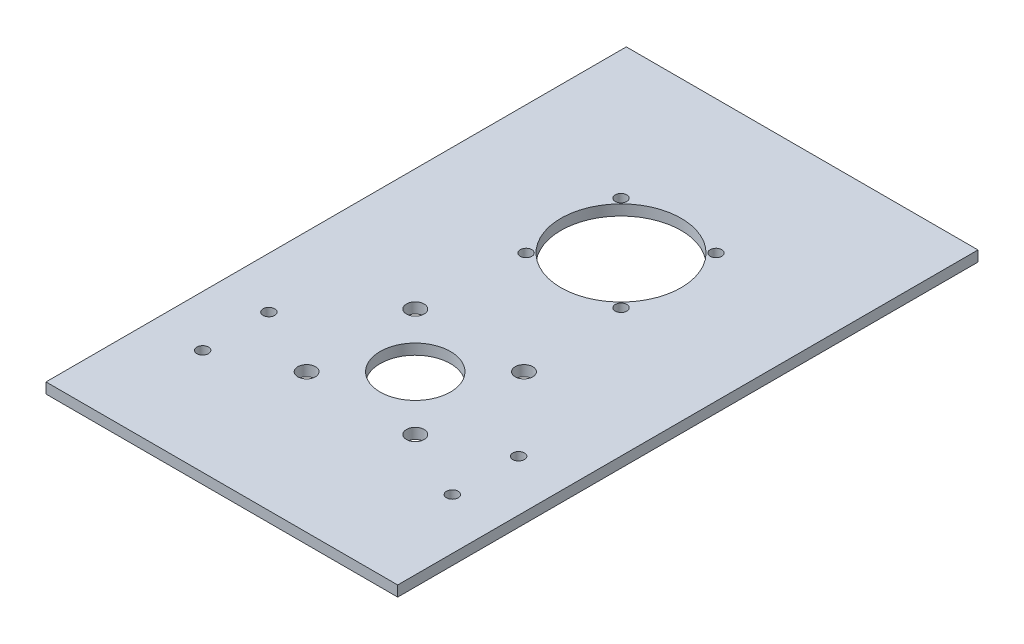
ISO-10303-21;
HEADER;
FILE_DESCRIPTION(('STEP AP214'),'2;1');
FILE_NAME('part.step','',(''),(''),'','','');
FILE_SCHEMA(('AUTOMOTIVE_DESIGN { 1 0 10303 214 1 1 1 1 }'));
ENDSEC;
DATA;
#1=APPLICATION_CONTEXT('core data for automotive mechanical design processes');
#2=APPLICATION_PROTOCOL_DEFINITION('international standard','automotive_design',2000,#1);
#3=PRODUCT_CONTEXT('',#1,'mechanical');
#4=PRODUCT('Part','Part','',(#3));
#5=PRODUCT_RELATED_PRODUCT_CATEGORY('part','',(#4));
#6=PRODUCT_DEFINITION_FORMATION('','',#4);
#7=PRODUCT_DEFINITION_CONTEXT('part definition',#1,'design');
#8=PRODUCT_DEFINITION('design','',#6,#7);
#9=PRODUCT_DEFINITION_SHAPE('','',#8);
#10=(LENGTH_UNIT() NAMED_UNIT(*) SI_UNIT(.MILLI.,.METRE.));
#11=(NAMED_UNIT(*) PLANE_ANGLE_UNIT() SI_UNIT($,.RADIAN.));
#12=(NAMED_UNIT(*) SI_UNIT($,.STERADIAN.) SOLID_ANGLE_UNIT());
#13=UNCERTAINTY_MEASURE_WITH_UNIT(LENGTH_MEASURE(1.E-05),#10,'distance_accuracy_value','');
#14=(GEOMETRIC_REPRESENTATION_CONTEXT(3) GLOBAL_UNCERTAINTY_ASSIGNED_CONTEXT((#13)) GLOBAL_UNIT_ASSIGNED_CONTEXT((#10,
#11,#12)) REPRESENTATION_CONTEXT('',''));
#15=CARTESIAN_POINT('',(0.,0.,0.));
#16=DIRECTION('',(0.,0.,1.));
#17=DIRECTION('',(1.,0.,0.));
#18=AXIS2_PLACEMENT_3D('',#15,#16,#17);
#19=CARTESIAN_POINT('',(0.,3.,0.));
#20=DIRECTION('',(0.,1.,0.));
#21=DIRECTION('',(0.,0.,1.));
#22=AXIS2_PLACEMENT_3D('',#19,#20,#21);
#23=PLANE('',#22);
#24=CARTESIAN_POINT('',(-35.5,3.,52.4648421845453));
#25=DIRECTION('',(0.,1.,0.));
#26=DIRECTION('',(0.,0.,1.));
#27=AXIS2_PLACEMENT_3D('',#24,#25,#26);
#28=CIRCLE('',#27,1.65);
#29=CARTESIAN_POINT('',(-35.5,3.,54.1148421845453));
#30=VERTEX_POINT('',#29);
#31=EDGE_CURVE('E187',#30,#30,#28,.T.);
#32=ORIENTED_EDGE('',*,*,#31,.F.);
#33=EDGE_LOOP('',(#32));
#34=FACE_BOUND('',#33,.T.);
#35=CARTESIAN_POINT('',(35.5,3.,33.6222296896705));
#36=DIRECTION('',(0.,1.,0.));
#37=DIRECTION('',(0.,0.,1.));
#38=AXIS2_PLACEMENT_3D('',#35,#36,#37);
#39=CIRCLE('',#38,1.65);
#40=CARTESIAN_POINT('',(35.5,3.,35.2722296896705));
#41=VERTEX_POINT('',#40);
#42=EDGE_CURVE('E175',#41,#41,#39,.T.);
#43=ORIENTED_EDGE('',*,*,#42,.F.);
#44=EDGE_LOOP('',(#43));
#45=FACE_BOUND('',#44,.T.);
#46=CARTESIAN_POINT('',(13.5,3.,-44.5));
#47=DIRECTION('',(0.,1.,0.));
#48=DIRECTION('',(0.,0.,1.));
#49=AXIS2_PLACEMENT_3D('',#46,#47,#48);
#50=CIRCLE('',#49,1.65);
#51=CARTESIAN_POINT('',(13.5,3.,-42.85));
#52=VERTEX_POINT('',#51);
#53=EDGE_CURVE('E163',#52,#52,#50,.T.);
#54=ORIENTED_EDGE('',*,*,#53,.F.);
#55=EDGE_LOOP('',(#54));
#56=FACE_BOUND('',#55,.T.);
#57=CARTESIAN_POINT('',(-13.5,3.,-17.5));
#58=DIRECTION('',(0.,1.,0.));
#59=DIRECTION('',(0.,0.,1.));
#60=AXIS2_PLACEMENT_3D('',#57,#58,#59);
#61=CIRCLE('',#60,1.65);
#62=CARTESIAN_POINT('',(-13.5,3.,-15.85));
#63=VERTEX_POINT('',#62);
#64=EDGE_CURVE('E151',#63,#63,#61,.T.);
#65=ORIENTED_EDGE('',*,*,#64,.F.);
#66=EDGE_LOOP('',(#65));
#67=FACE_BOUND('',#66,.T.);
#68=CARTESIAN_POINT('',(15.45,3.,12.05));
#69=DIRECTION('',(0.,1.,0.));
#70=DIRECTION('',(0.,0.,1.));
#71=AXIS2_PLACEMENT_3D('',#68,#69,#70);
#72=CIRCLE('',#71,2.5);
#73=CARTESIAN_POINT('',(15.45,3.,14.55));
#74=VERTEX_POINT('',#73);
#75=EDGE_CURVE('E139',#74,#74,#72,.T.);
#76=ORIENTED_EDGE('',*,*,#75,.F.);
#77=EDGE_LOOP('',(#76));
#78=FACE_BOUND('',#77,.T.);
#79=CARTESIAN_POINT('',(-15.45,3.,42.95));
#80=DIRECTION('',(0.,1.,0.));
#81=DIRECTION('',(0.,0.,1.));
#82=AXIS2_PLACEMENT_3D('',#79,#80,#81);
#83=CIRCLE('',#82,2.5);
#84=CARTESIAN_POINT('',(-15.45,3.,45.45));
#85=VERTEX_POINT('',#84);
#86=EDGE_CURVE('E127',#85,#85,#83,.T.);
#87=ORIENTED_EDGE('',*,*,#86,.F.);
#88=EDGE_LOOP('',(#87));
#89=FACE_BOUND('',#88,.T.);
#90=CARTESIAN_POINT('',(0.,3.,27.5));
#91=DIRECTION('',(0.,1.,0.));
#92=DIRECTION('',(0.,0.,1.));
#93=AXIS2_PLACEMENT_3D('',#90,#91,#92);
#94=CIRCLE('',#93,10.);
#95=CARTESIAN_POINT('',(0.,3.,37.5));
#96=VERTEX_POINT('',#95);
#97=EDGE_CURVE('E106',#96,#96,#94,.T.);
#98=ORIENTED_EDGE('',*,*,#97,.F.);
#99=EDGE_LOOP('',(#98));
#100=FACE_BOUND('',#99,.T.);
#101=DIRECTION('',(0.,0.,-1.));
#102=VECTOR('',#101,1.);
#103=CARTESIAN_POINT('',(50.,3.,-82.5));
#104=LINE('',#103,#102);
#105=CARTESIAN_POINT('',(50.,3.,82.5));
#106=VERTEX_POINT('',#105);
#107=CARTESIAN_POINT('',(50.,3.,-82.5));
#108=VERTEX_POINT('',#107);
#109=EDGE_CURVE('E91',#106,#108,#104,.T.);
#110=ORIENTED_EDGE('',*,*,#109,.T.);
#111=DIRECTION('',(-1.,0.,0.));
#112=VECTOR('',#111,1.);
#113=CARTESIAN_POINT('',(-50.,3.,-82.5));
#114=LINE('',#113,#112);
#115=CARTESIAN_POINT('',(-50.,3.,-82.5));
#116=VERTEX_POINT('',#115);
#117=EDGE_CURVE('E86',#108,#116,#114,.T.);
#118=ORIENTED_EDGE('',*,*,#117,.T.);
#119=DIRECTION('',(0.,0.,1.));
#120=VECTOR('',#119,1.);
#121=CARTESIAN_POINT('',(-50.,3.,-82.5));
#122=LINE('',#121,#120);
#123=CARTESIAN_POINT('',(-50.,3.,82.5));
#124=VERTEX_POINT('',#123);
#125=EDGE_CURVE('E89',#116,#124,#122,.T.);
#126=ORIENTED_EDGE('',*,*,#125,.T.);
#127=DIRECTION('',(1.,0.,0.));
#128=VECTOR('',#127,1.);
#129=CARTESIAN_POINT('',(-50.,3.,82.5));
#130=LINE('',#129,#128);
#131=EDGE_CURVE('E56',#124,#106,#130,.T.);
#132=ORIENTED_EDGE('',*,*,#131,.T.);
#133=EDGE_LOOP('',(#110,#118,#126,#132));
#134=FACE_BOUND('',#133,.T.);
#135=CARTESIAN_POINT('',(0.,3.,-31.));
#136=DIRECTION('',(0.,1.,0.));
#137=DIRECTION('',(0.,0.,1.));
#138=AXIS2_PLACEMENT_3D('',#135,#136,#137);
#139=CIRCLE('',#138,17.1);
#140=CARTESIAN_POINT('',(0.,3.,-13.9));
#141=VERTEX_POINT('',#140);
#142=EDGE_CURVE('E121',#141,#141,#139,.T.);
#143=ORIENTED_EDGE('',*,*,#142,.F.);
#144=EDGE_LOOP('',(#143));
#145=FACE_BOUND('',#144,.T.);
#146=CARTESIAN_POINT('',(15.45,3.,42.95));
#147=DIRECTION('',(0.,1.,0.));
#148=DIRECTION('',(0.,0.,1.));
#149=AXIS2_PLACEMENT_3D('',#146,#147,#148);
#150=CIRCLE('',#149,2.5);
#151=CARTESIAN_POINT('',(15.45,3.,45.45));
#152=VERTEX_POINT('',#151);
#153=EDGE_CURVE('E133',#152,#152,#150,.T.);
#154=ORIENTED_EDGE('',*,*,#153,.F.);
#155=EDGE_LOOP('',(#154));
#156=FACE_BOUND('',#155,.T.);
#157=CARTESIAN_POINT('',(-15.45,3.,12.05));
#158=DIRECTION('',(0.,1.,0.));
#159=DIRECTION('',(0.,0.,1.));
#160=AXIS2_PLACEMENT_3D('',#157,#158,#159);
#161=CIRCLE('',#160,2.5);
#162=CARTESIAN_POINT('',(-15.45,3.,14.55));
#163=VERTEX_POINT('',#162);
#164=EDGE_CURVE('E145',#163,#163,#161,.T.);
#165=ORIENTED_EDGE('',*,*,#164,.F.);
#166=EDGE_LOOP('',(#165));
#167=FACE_BOUND('',#166,.T.);
#168=CARTESIAN_POINT('',(13.5,3.,-17.5));
#169=DIRECTION('',(0.,1.,0.));
#170=DIRECTION('',(0.,0.,1.));
#171=AXIS2_PLACEMENT_3D('',#168,#169,#170);
#172=CIRCLE('',#171,1.65);
#173=CARTESIAN_POINT('',(13.5,3.,-15.85));
#174=VERTEX_POINT('',#173);
#175=EDGE_CURVE('E157',#174,#174,#172,.T.);
#176=ORIENTED_EDGE('',*,*,#175,.F.);
#177=EDGE_LOOP('',(#176));
#178=FACE_BOUND('',#177,.T.);
#179=CARTESIAN_POINT('',(-13.5,3.,-44.5));
#180=DIRECTION('',(0.,1.,0.));
#181=DIRECTION('',(0.,0.,1.));
#182=AXIS2_PLACEMENT_3D('',#179,#180,#181);
#183=CIRCLE('',#182,1.65);
#184=CARTESIAN_POINT('',(-13.5,3.,-42.85));
#185=VERTEX_POINT('',#184);
#186=EDGE_CURVE('E169',#185,#185,#183,.T.);
#187=ORIENTED_EDGE('',*,*,#186,.F.);
#188=EDGE_LOOP('',(#187));
#189=FACE_BOUND('',#188,.T.);
#190=CARTESIAN_POINT('',(35.5,3.,52.4648421845453));
#191=DIRECTION('',(0.,1.,0.));
#192=DIRECTION('',(0.,0.,1.));
#193=AXIS2_PLACEMENT_3D('',#190,#191,#192);
#194=CIRCLE('',#193,1.65);
#195=CARTESIAN_POINT('',(35.5,3.,54.1148421845453));
#196=VERTEX_POINT('',#195);
#197=EDGE_CURVE('E181',#196,#196,#194,.T.);
#198=ORIENTED_EDGE('',*,*,#197,.F.);
#199=EDGE_LOOP('',(#198));
#200=FACE_BOUND('',#199,.T.);
#201=CARTESIAN_POINT('',(-35.5,3.,33.6222296896705));
#202=DIRECTION('',(0.,1.,0.));
#203=DIRECTION('',(0.,0.,1.));
#204=AXIS2_PLACEMENT_3D('',#201,#202,#203);
#205=CIRCLE('',#204,1.65);
#206=CARTESIAN_POINT('',(-35.5,3.,35.2722296896705));
#207=VERTEX_POINT('',#206);
#208=EDGE_CURVE('E193',#207,#207,#205,.T.);
#209=ORIENTED_EDGE('',*,*,#208,.F.);
#210=EDGE_LOOP('',(#209));
#211=FACE_BOUND('',#210,.T.);
#212=ADVANCED_FACE('F39',(#34,#45,#56,#67,#78,#89,#100,#134,#145,#156,#167,#178,#189,#200,#211),
#23,.T.);
#213=CARTESIAN_POINT('',(0.,0.,0.));
#214=DIRECTION('',(0.,1.,0.));
#215=DIRECTION('',(0.,0.,1.));
#216=AXIS2_PLACEMENT_3D('',#213,#214,#215);
#217=PLANE('',#216);
#218=DIRECTION('',(0.,0.,-1.));
#219=VECTOR('',#218,1.);
#220=CARTESIAN_POINT('',(50.,0.,-82.5));
#221=LINE('',#220,#219);
#222=CARTESIAN_POINT('',(50.,0.,82.5));
#223=VERTEX_POINT('',#222);
#224=CARTESIAN_POINT('',(50.,0.,-82.5));
#225=VERTEX_POINT('',#224);
#226=EDGE_CURVE('E103',#223,#225,#221,.T.);
#227=ORIENTED_EDGE('',*,*,#226,.F.);
#228=DIRECTION('',(1.,0.,0.));
#229=VECTOR('',#228,1.);
#230=CARTESIAN_POINT('',(-50.,0.,82.5));
#231=LINE('',#230,#229);
#232=CARTESIAN_POINT('',(-50.,0.,82.5));
#233=VERTEX_POINT('',#232);
#234=EDGE_CURVE('E79',#233,#223,#231,.T.);
#235=ORIENTED_EDGE('',*,*,#234,.F.);
#236=DIRECTION('',(0.,0.,1.));
#237=VECTOR('',#236,1.);
#238=CARTESIAN_POINT('',(-50.,0.,-82.5));
#239=LINE('',#238,#237);
#240=CARTESIAN_POINT('',(-50.,0.,-82.5));
#241=VERTEX_POINT('',#240);
#242=EDGE_CURVE('E73',#241,#233,#239,.T.);
#243=ORIENTED_EDGE('',*,*,#242,.F.);
#244=DIRECTION('',(-1.,0.,0.));
#245=VECTOR('',#244,1.);
#246=CARTESIAN_POINT('',(-50.,0.,-82.5));
#247=LINE('',#246,#245);
#248=EDGE_CURVE('E95',#225,#241,#247,.T.);
#249=ORIENTED_EDGE('',*,*,#248,.F.);
#250=EDGE_LOOP('',(#227,#235,#243,#249));
#251=FACE_BOUND('',#250,.T.);
#252=CARTESIAN_POINT('',(0.,0.,27.5));
#253=DIRECTION('',(0.,1.,0.));
#254=DIRECTION('',(0.,0.,1.));
#255=AXIS2_PLACEMENT_3D('',#252,#253,#254);
#256=CIRCLE('',#255,10.);
#257=CARTESIAN_POINT('',(0.,0.,37.5));
#258=VERTEX_POINT('',#257);
#259=EDGE_CURVE('E118',#258,#258,#256,.T.);
#260=ORIENTED_EDGE('',*,*,#259,.T.);
#261=EDGE_LOOP('',(#260));
#262=FACE_BOUND('',#261,.T.);
#263=CARTESIAN_POINT('',(0.,0.,-31.));
#264=DIRECTION('',(0.,1.,0.));
#265=DIRECTION('',(0.,0.,1.));
#266=AXIS2_PLACEMENT_3D('',#263,#264,#265);
#267=CIRCLE('',#266,17.1);
#268=CARTESIAN_POINT('',(0.,0.,-13.9));
#269=VERTEX_POINT('',#268);
#270=EDGE_CURVE('E124',#269,#269,#267,.T.);
#271=ORIENTED_EDGE('',*,*,#270,.T.);
#272=EDGE_LOOP('',(#271));
#273=FACE_BOUND('',#272,.T.);
#274=CARTESIAN_POINT('',(-15.45,0.,42.95));
#275=DIRECTION('',(0.,1.,0.));
#276=DIRECTION('',(0.,0.,1.));
#277=AXIS2_PLACEMENT_3D('',#274,#275,#276);
#278=CIRCLE('',#277,2.5);
#279=CARTESIAN_POINT('',(-15.45,0.,45.45));
#280=VERTEX_POINT('',#279);
#281=EDGE_CURVE('E130',#280,#280,#278,.T.);
#282=ORIENTED_EDGE('',*,*,#281,.T.);
#283=EDGE_LOOP('',(#282));
#284=FACE_BOUND('',#283,.T.);
#285=CARTESIAN_POINT('',(15.45,0.,42.95));
#286=DIRECTION('',(0.,1.,0.));
#287=DIRECTION('',(0.,0.,1.));
#288=AXIS2_PLACEMENT_3D('',#285,#286,#287);
#289=CIRCLE('',#288,2.5);
#290=CARTESIAN_POINT('',(15.45,0.,45.45));
#291=VERTEX_POINT('',#290);
#292=EDGE_CURVE('E136',#291,#291,#289,.T.);
#293=ORIENTED_EDGE('',*,*,#292,.T.);
#294=EDGE_LOOP('',(#293));
#295=FACE_BOUND('',#294,.T.);
#296=CARTESIAN_POINT('',(15.45,0.,12.05));
#297=DIRECTION('',(0.,1.,0.));
#298=DIRECTION('',(0.,0.,1.));
#299=AXIS2_PLACEMENT_3D('',#296,#297,#298);
#300=CIRCLE('',#299,2.5);
#301=CARTESIAN_POINT('',(15.45,0.,14.55));
#302=VERTEX_POINT('',#301);
#303=EDGE_CURVE('E142',#302,#302,#300,.T.);
#304=ORIENTED_EDGE('',*,*,#303,.T.);
#305=EDGE_LOOP('',(#304));
#306=FACE_BOUND('',#305,.T.);
#307=CARTESIAN_POINT('',(-15.45,0.,12.05));
#308=DIRECTION('',(0.,1.,0.));
#309=DIRECTION('',(0.,0.,1.));
#310=AXIS2_PLACEMENT_3D('',#307,#308,#309);
#311=CIRCLE('',#310,2.5);
#312=CARTESIAN_POINT('',(-15.45,0.,14.55));
#313=VERTEX_POINT('',#312);
#314=EDGE_CURVE('E148',#313,#313,#311,.T.);
#315=ORIENTED_EDGE('',*,*,#314,.T.);
#316=EDGE_LOOP('',(#315));
#317=FACE_BOUND('',#316,.T.);
#318=CARTESIAN_POINT('',(-13.5,0.,-17.5));
#319=DIRECTION('',(0.,1.,0.));
#320=DIRECTION('',(0.,0.,1.));
#321=AXIS2_PLACEMENT_3D('',#318,#319,#320);
#322=CIRCLE('',#321,1.65);
#323=CARTESIAN_POINT('',(-13.5,0.,-15.85));
#324=VERTEX_POINT('',#323);
#325=EDGE_CURVE('E154',#324,#324,#322,.T.);
#326=ORIENTED_EDGE('',*,*,#325,.T.);
#327=EDGE_LOOP('',(#326));
#328=FACE_BOUND('',#327,.T.);
#329=CARTESIAN_POINT('',(13.5,0.,-17.5));
#330=DIRECTION('',(0.,1.,0.));
#331=DIRECTION('',(0.,0.,1.));
#332=AXIS2_PLACEMENT_3D('',#329,#330,#331);
#333=CIRCLE('',#332,1.65);
#334=CARTESIAN_POINT('',(13.5,0.,-15.85));
#335=VERTEX_POINT('',#334);
#336=EDGE_CURVE('E160',#335,#335,#333,.T.);
#337=ORIENTED_EDGE('',*,*,#336,.T.);
#338=EDGE_LOOP('',(#337));
#339=FACE_BOUND('',#338,.T.);
#340=CARTESIAN_POINT('',(13.5,0.,-44.5));
#341=DIRECTION('',(0.,1.,0.));
#342=DIRECTION('',(0.,0.,1.));
#343=AXIS2_PLACEMENT_3D('',#340,#341,#342);
#344=CIRCLE('',#343,1.65);
#345=CARTESIAN_POINT('',(13.5,0.,-42.85));
#346=VERTEX_POINT('',#345);
#347=EDGE_CURVE('E166',#346,#346,#344,.T.);
#348=ORIENTED_EDGE('',*,*,#347,.T.);
#349=EDGE_LOOP('',(#348));
#350=FACE_BOUND('',#349,.T.);
#351=CARTESIAN_POINT('',(-13.5,0.,-44.5));
#352=DIRECTION('',(0.,1.,0.));
#353=DIRECTION('',(0.,0.,1.));
#354=AXIS2_PLACEMENT_3D('',#351,#352,#353);
#355=CIRCLE('',#354,1.65);
#356=CARTESIAN_POINT('',(-13.5,0.,-42.85));
#357=VERTEX_POINT('',#356);
#358=EDGE_CURVE('E172',#357,#357,#355,.T.);
#359=ORIENTED_EDGE('',*,*,#358,.T.);
#360=EDGE_LOOP('',(#359));
#361=FACE_BOUND('',#360,.T.);
#362=CARTESIAN_POINT('',(35.5,0.,33.6222296896705));
#363=DIRECTION('',(0.,1.,0.));
#364=DIRECTION('',(0.,0.,1.));
#365=AXIS2_PLACEMENT_3D('',#362,#363,#364);
#366=CIRCLE('',#365,1.65);
#367=CARTESIAN_POINT('',(35.5,0.,35.2722296896705));
#368=VERTEX_POINT('',#367);
#369=EDGE_CURVE('E178',#368,#368,#366,.T.);
#370=ORIENTED_EDGE('',*,*,#369,.T.);
#371=EDGE_LOOP('',(#370));
#372=FACE_BOUND('',#371,.T.);
#373=CARTESIAN_POINT('',(35.5,0.,52.4648421845453));
#374=DIRECTION('',(0.,1.,0.));
#375=DIRECTION('',(0.,0.,1.));
#376=AXIS2_PLACEMENT_3D('',#373,#374,#375);
#377=CIRCLE('',#376,1.65);
#378=CARTESIAN_POINT('',(35.5,0.,54.1148421845453));
#379=VERTEX_POINT('',#378);
#380=EDGE_CURVE('E184',#379,#379,#377,.T.);
#381=ORIENTED_EDGE('',*,*,#380,.T.);
#382=EDGE_LOOP('',(#381));
#383=FACE_BOUND('',#382,.T.);
#384=CARTESIAN_POINT('',(-35.5,0.,52.4648421845453));
#385=DIRECTION('',(0.,1.,0.));
#386=DIRECTION('',(0.,0.,1.));
#387=AXIS2_PLACEMENT_3D('',#384,#385,#386);
#388=CIRCLE('',#387,1.65);
#389=CARTESIAN_POINT('',(-35.5,0.,54.1148421845453));
#390=VERTEX_POINT('',#389);
#391=EDGE_CURVE('E190',#390,#390,#388,.T.);
#392=ORIENTED_EDGE('',*,*,#391,.T.);
#393=EDGE_LOOP('',(#392));
#394=FACE_BOUND('',#393,.T.);
#395=CARTESIAN_POINT('',(-35.5,0.,33.6222296896705));
#396=DIRECTION('',(0.,1.,0.));
#397=DIRECTION('',(0.,0.,1.));
#398=AXIS2_PLACEMENT_3D('',#395,#396,#397);
#399=CIRCLE('',#398,1.65);
#400=CARTESIAN_POINT('',(-35.5,0.,35.2722296896705));
#401=VERTEX_POINT('',#400);
#402=EDGE_CURVE('E196',#401,#401,#399,.T.);
#403=ORIENTED_EDGE('',*,*,#402,.T.);
#404=EDGE_LOOP('',(#403));
#405=FACE_BOUND('',#404,.T.);
#406=ADVANCED_FACE('F114',(#251,#262,#273,#284,#295,#306,#317,#328,#339,#350,#361,#372,#383,
#394,#405),#217,.F.);
#407=CARTESIAN_POINT('',(50.,3.,-82.5));
#408=DIRECTION('',(-1.,0.,0.));
#409=DIRECTION('',(0.,0.,1.));
#410=AXIS2_PLACEMENT_3D('',#407,#408,#409);
#411=PLANE('',#410);
#412=ORIENTED_EDGE('',*,*,#226,.T.);
#413=DIRECTION('',(0.,-1.,0.));
#414=VECTOR('',#413,1.);
#415=CARTESIAN_POINT('',(50.,3.,-82.5));
#416=LINE('',#415,#414);
#417=EDGE_CURVE('E11',#108,#225,#416,.T.);
#418=ORIENTED_EDGE('',*,*,#417,.F.);
#419=ORIENTED_EDGE('',*,*,#109,.F.);
#420=DIRECTION('',(0.,-1.,0.));
#421=VECTOR('',#420,1.);
#422=CARTESIAN_POINT('',(50.,3.,82.5));
#423=LINE('',#422,#421);
#424=EDGE_CURVE('E99',#106,#223,#423,.T.);
#425=ORIENTED_EDGE('',*,*,#424,.T.);
#426=EDGE_LOOP('',(#412,#418,#419,#425));
#427=FACE_BOUND('',#426,.T.);
#428=ADVANCED_FACE('F41',(#427),#411,.F.);
#429=CARTESIAN_POINT('',(-50.,3.,-82.5));
#430=DIRECTION('',(0.,0.,1.));
#431=DIRECTION('',(1.,0.,0.));
#432=AXIS2_PLACEMENT_3D('',#429,#430,#431);
#433=PLANE('',#432);
#434=ORIENTED_EDGE('',*,*,#248,.T.);
#435=DIRECTION('',(0.,-1.,0.));
#436=VECTOR('',#435,1.);
#437=CARTESIAN_POINT('',(-50.,3.,-82.5));
#438=LINE('',#437,#436);
#439=EDGE_CURVE('E48',#116,#241,#438,.T.);
#440=ORIENTED_EDGE('',*,*,#439,.F.);
#441=ORIENTED_EDGE('',*,*,#117,.F.);
#442=ORIENTED_EDGE('',*,*,#417,.T.);
#443=EDGE_LOOP('',(#434,#440,#441,#442));
#444=FACE_BOUND('',#443,.T.);
#445=ADVANCED_FACE('F94',(#444),#433,.F.);
#446=CARTESIAN_POINT('',(-50.,3.,-82.5));
#447=DIRECTION('',(1.,0.,0.));
#448=DIRECTION('',(0.,0.,-1.));
#449=AXIS2_PLACEMENT_3D('',#446,#447,#448);
#450=PLANE('',#449);
#451=ORIENTED_EDGE('',*,*,#242,.T.);
#452=DIRECTION('',(0.,-1.,0.));
#453=VECTOR('',#452,1.);
#454=CARTESIAN_POINT('',(-50.,3.,82.5));
#455=LINE('',#454,#453);
#456=EDGE_CURVE('E96',#124,#233,#455,.T.);
#457=ORIENTED_EDGE('',*,*,#456,.F.);
#458=ORIENTED_EDGE('',*,*,#125,.F.);
#459=ORIENTED_EDGE('',*,*,#439,.T.);
#460=EDGE_LOOP('',(#451,#457,#458,#459));
#461=FACE_BOUND('',#460,.T.);
#462=ADVANCED_FACE('F97',(#461),#450,.F.);
#463=CARTESIAN_POINT('',(-50.,3.,82.5));
#464=DIRECTION('',(0.,0.,-1.));
#465=DIRECTION('',(-1.,0.,0.));
#466=AXIS2_PLACEMENT_3D('',#463,#464,#465);
#467=PLANE('',#466);
#468=ORIENTED_EDGE('',*,*,#234,.T.);
#469=ORIENTED_EDGE('',*,*,#424,.F.);
#470=ORIENTED_EDGE('',*,*,#131,.F.);
#471=ORIENTED_EDGE('',*,*,#456,.T.);
#472=EDGE_LOOP('',(#468,#469,#470,#471));
#473=FACE_BOUND('',#472,.T.);
#474=ADVANCED_FACE('F111',(#473),#467,.F.);
#475=CARTESIAN_POINT('',(0.,3.,27.5));
#476=DIRECTION('',(0.,-1.,0.));
#477=DIRECTION('',(0.,0.,-1.));
#478=AXIS2_PLACEMENT_3D('',#475,#476,#477);
#479=CYLINDRICAL_SURFACE('',#478,10.);
#480=ORIENTED_EDGE('',*,*,#97,.T.);
#481=EDGE_LOOP('',(#480));
#482=FACE_BOUND('',#481,.T.);
#483=ORIENTED_EDGE('',*,*,#259,.F.);
#484=EDGE_LOOP('',(#483));
#485=FACE_BOUND('',#484,.T.);
#486=ADVANCED_FACE('F215',(#482,#485),#479,.F.);
#487=CARTESIAN_POINT('',(0.,3.,-31.));
#488=DIRECTION('',(0.,-1.,0.));
#489=DIRECTION('',(0.,0.,-1.));
#490=AXIS2_PLACEMENT_3D('',#487,#488,#489);
#491=CYLINDRICAL_SURFACE('',#490,17.1);
#492=ORIENTED_EDGE('',*,*,#142,.T.);
#493=EDGE_LOOP('',(#492));
#494=FACE_BOUND('',#493,.T.);
#495=ORIENTED_EDGE('',*,*,#270,.F.);
#496=EDGE_LOOP('',(#495));
#497=FACE_BOUND('',#496,.T.);
#498=ADVANCED_FACE('F260',(#494,#497),#491,.F.);
#499=CARTESIAN_POINT('',(-15.45,3.,42.95));
#500=DIRECTION('',(0.,-1.,0.));
#501=DIRECTION('',(0.,0.,-1.));
#502=AXIS2_PLACEMENT_3D('',#499,#500,#501);
#503=CYLINDRICAL_SURFACE('',#502,2.5);
#504=ORIENTED_EDGE('',*,*,#86,.T.);
#505=EDGE_LOOP('',(#504));
#506=FACE_BOUND('',#505,.T.);
#507=ORIENTED_EDGE('',*,*,#281,.F.);
#508=EDGE_LOOP('',(#507));
#509=FACE_BOUND('',#508,.T.);
#510=ADVANCED_FACE('F268',(#506,#509),#503,.F.);
#511=CARTESIAN_POINT('',(15.45,3.,42.95));
#512=DIRECTION('',(0.,-1.,0.));
#513=DIRECTION('',(0.,0.,-1.));
#514=AXIS2_PLACEMENT_3D('',#511,#512,#513);
#515=CYLINDRICAL_SURFACE('',#514,2.5);
#516=ORIENTED_EDGE('',*,*,#153,.T.);
#517=EDGE_LOOP('',(#516));
#518=FACE_BOUND('',#517,.T.);
#519=ORIENTED_EDGE('',*,*,#292,.F.);
#520=EDGE_LOOP('',(#519));
#521=FACE_BOUND('',#520,.T.);
#522=ADVANCED_FACE('F276',(#518,#521),#515,.F.);
#523=CARTESIAN_POINT('',(15.45,3.,12.05));
#524=DIRECTION('',(0.,-1.,0.));
#525=DIRECTION('',(0.,0.,-1.));
#526=AXIS2_PLACEMENT_3D('',#523,#524,#525);
#527=CYLINDRICAL_SURFACE('',#526,2.5);
#528=ORIENTED_EDGE('',*,*,#75,.T.);
#529=EDGE_LOOP('',(#528));
#530=FACE_BOUND('',#529,.T.);
#531=ORIENTED_EDGE('',*,*,#303,.F.);
#532=EDGE_LOOP('',(#531));
#533=FACE_BOUND('',#532,.T.);
#534=ADVANCED_FACE('F285',(#530,#533),#527,.F.);
#535=CARTESIAN_POINT('',(-15.45,3.,12.05));
#536=DIRECTION('',(0.,-1.,0.));
#537=DIRECTION('',(0.,0.,-1.));
#538=AXIS2_PLACEMENT_3D('',#535,#536,#537);
#539=CYLINDRICAL_SURFACE('',#538,2.5);
#540=ORIENTED_EDGE('',*,*,#164,.T.);
#541=EDGE_LOOP('',(#540));
#542=FACE_BOUND('',#541,.T.);
#543=ORIENTED_EDGE('',*,*,#314,.F.);
#544=EDGE_LOOP('',(#543));
#545=FACE_BOUND('',#544,.T.);
#546=ADVANCED_FACE('F294',(#542,#545),#539,.F.);
#547=CARTESIAN_POINT('',(-13.5,3.,-17.5));
#548=DIRECTION('',(0.,-1.,0.));
#549=DIRECTION('',(0.,0.,-1.));
#550=AXIS2_PLACEMENT_3D('',#547,#548,#549);
#551=CYLINDRICAL_SURFACE('',#550,1.65);
#552=ORIENTED_EDGE('',*,*,#64,.T.);
#553=EDGE_LOOP('',(#552));
#554=FACE_BOUND('',#553,.T.);
#555=ORIENTED_EDGE('',*,*,#325,.F.);
#556=EDGE_LOOP('',(#555));
#557=FACE_BOUND('',#556,.T.);
#558=ADVANCED_FACE('F303',(#554,#557),#551,.F.);
#559=CARTESIAN_POINT('',(13.5,3.,-17.5));
#560=DIRECTION('',(0.,-1.,0.));
#561=DIRECTION('',(0.,0.,-1.));
#562=AXIS2_PLACEMENT_3D('',#559,#560,#561);
#563=CYLINDRICAL_SURFACE('',#562,1.65);
#564=ORIENTED_EDGE('',*,*,#175,.T.);
#565=EDGE_LOOP('',(#564));
#566=FACE_BOUND('',#565,.T.);
#567=ORIENTED_EDGE('',*,*,#336,.F.);
#568=EDGE_LOOP('',(#567));
#569=FACE_BOUND('',#568,.T.);
#570=ADVANCED_FACE('F312',(#566,#569),#563,.F.);
#571=CARTESIAN_POINT('',(13.5,3.,-44.5));
#572=DIRECTION('',(0.,-1.,0.));
#573=DIRECTION('',(0.,0.,-1.));
#574=AXIS2_PLACEMENT_3D('',#571,#572,#573);
#575=CYLINDRICAL_SURFACE('',#574,1.65);
#576=ORIENTED_EDGE('',*,*,#53,.T.);
#577=EDGE_LOOP('',(#576));
#578=FACE_BOUND('',#577,.T.);
#579=ORIENTED_EDGE('',*,*,#347,.F.);
#580=EDGE_LOOP('',(#579));
#581=FACE_BOUND('',#580,.T.);
#582=ADVANCED_FACE('F321',(#578,#581),#575,.F.);
#583=CARTESIAN_POINT('',(-13.5,3.,-44.5));
#584=DIRECTION('',(0.,-1.,0.));
#585=DIRECTION('',(0.,0.,-1.));
#586=AXIS2_PLACEMENT_3D('',#583,#584,#585);
#587=CYLINDRICAL_SURFACE('',#586,1.65);
#588=ORIENTED_EDGE('',*,*,#186,.T.);
#589=EDGE_LOOP('',(#588));
#590=FACE_BOUND('',#589,.T.);
#591=ORIENTED_EDGE('',*,*,#358,.F.);
#592=EDGE_LOOP('',(#591));
#593=FACE_BOUND('',#592,.T.);
#594=ADVANCED_FACE('F330',(#590,#593),#587,.F.);
#595=CARTESIAN_POINT('',(35.5,3.,33.6222296896705));
#596=DIRECTION('',(0.,-1.,0.));
#597=DIRECTION('',(0.,0.,-1.));
#598=AXIS2_PLACEMENT_3D('',#595,#596,#597);
#599=CYLINDRICAL_SURFACE('',#598,1.65);
#600=ORIENTED_EDGE('',*,*,#42,.T.);
#601=EDGE_LOOP('',(#600));
#602=FACE_BOUND('',#601,.T.);
#603=ORIENTED_EDGE('',*,*,#369,.F.);
#604=EDGE_LOOP('',(#603));
#605=FACE_BOUND('',#604,.T.);
#606=ADVANCED_FACE('F339',(#602,#605),#599,.F.);
#607=CARTESIAN_POINT('',(35.5,3.,52.4648421845453));
#608=DIRECTION('',(0.,-1.,0.));
#609=DIRECTION('',(0.,0.,-1.));
#610=AXIS2_PLACEMENT_3D('',#607,#608,#609);
#611=CYLINDRICAL_SURFACE('',#610,1.65);
#612=ORIENTED_EDGE('',*,*,#197,.T.);
#613=EDGE_LOOP('',(#612));
#614=FACE_BOUND('',#613,.T.);
#615=ORIENTED_EDGE('',*,*,#380,.F.);
#616=EDGE_LOOP('',(#615));
#617=FACE_BOUND('',#616,.T.);
#618=ADVANCED_FACE('F348',(#614,#617),#611,.F.);
#619=CARTESIAN_POINT('',(-35.5,3.,52.4648421845453));
#620=DIRECTION('',(0.,-1.,0.));
#621=DIRECTION('',(0.,0.,-1.));
#622=AXIS2_PLACEMENT_3D('',#619,#620,#621);
#623=CYLINDRICAL_SURFACE('',#622,1.65);
#624=ORIENTED_EDGE('',*,*,#31,.T.);
#625=EDGE_LOOP('',(#624));
#626=FACE_BOUND('',#625,.T.);
#627=ORIENTED_EDGE('',*,*,#391,.F.);
#628=EDGE_LOOP('',(#627));
#629=FACE_BOUND('',#628,.T.);
#630=ADVANCED_FACE('F357',(#626,#629),#623,.F.);
#631=CARTESIAN_POINT('',(-35.5,3.,33.6222296896705));
#632=DIRECTION('',(0.,-1.,0.));
#633=DIRECTION('',(0.,0.,-1.));
#634=AXIS2_PLACEMENT_3D('',#631,#632,#633);
#635=CYLINDRICAL_SURFACE('',#634,1.65);
#636=ORIENTED_EDGE('',*,*,#208,.T.);
#637=EDGE_LOOP('',(#636));
#638=FACE_BOUND('',#637,.T.);
#639=ORIENTED_EDGE('',*,*,#402,.F.);
#640=EDGE_LOOP('',(#639));
#641=FACE_BOUND('',#640,.T.);
#642=ADVANCED_FACE('F202',(#638,#641),#635,.F.);
#643=CLOSED_SHELL('',(#212,#406,#428,#445,#462,#474,#486,#498,#510,#522,#534,#546,#558,#570,
#582,#594,#606,#618,#630,#642));
#644=MANIFOLD_SOLID_BREP('B2',#643);
#645=ADVANCED_BREP_SHAPE_REPRESENTATION('',(#18,#644),#14);
#646=SHAPE_DEFINITION_REPRESENTATION(#9,#645);
ENDSEC;
END-ISO-10303-21;
